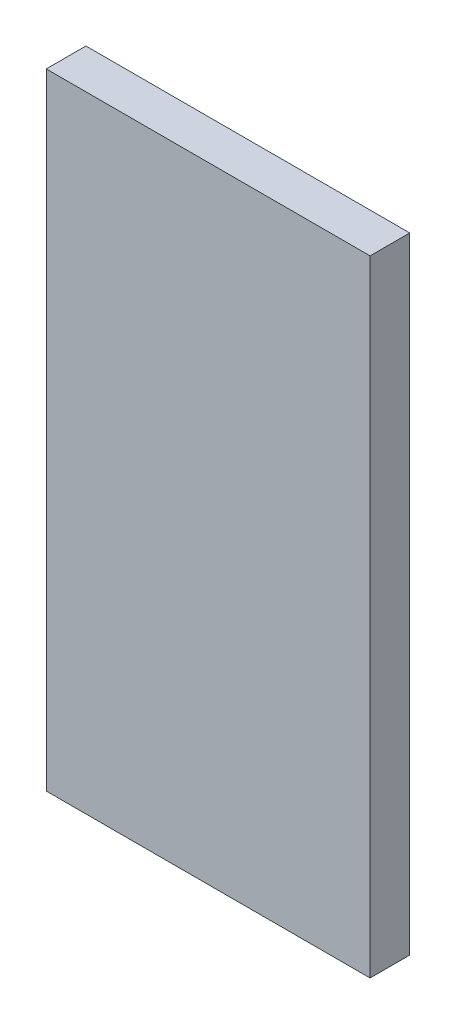
ISO-10303-21;
HEADER;
FILE_DESCRIPTION(('STEP AP214'),'2;1');
FILE_NAME('part.step','',(''),(''),'','','');
FILE_SCHEMA(('AUTOMOTIVE_DESIGN { 1 0 10303 214 1 1 1 1 }'));
ENDSEC;
DATA;
#1=APPLICATION_CONTEXT('core data for automotive mechanical design processes');
#2=APPLICATION_PROTOCOL_DEFINITION('international standard','automotive_design',2000,#1);
#3=PRODUCT_CONTEXT('',#1,'mechanical');
#4=PRODUCT('Part','Part','',(#3));
#5=PRODUCT_RELATED_PRODUCT_CATEGORY('part','',(#4));
#6=PRODUCT_DEFINITION_FORMATION('','',#4);
#7=PRODUCT_DEFINITION_CONTEXT('part definition',#1,'design');
#8=PRODUCT_DEFINITION('design','',#6,#7);
#9=PRODUCT_DEFINITION_SHAPE('','',#8);
#10=(LENGTH_UNIT() NAMED_UNIT(*) SI_UNIT(.MILLI.,.METRE.));
#11=(NAMED_UNIT(*) PLANE_ANGLE_UNIT() SI_UNIT($,.RADIAN.));
#12=(NAMED_UNIT(*) SI_UNIT($,.STERADIAN.) SOLID_ANGLE_UNIT());
#13=UNCERTAINTY_MEASURE_WITH_UNIT(LENGTH_MEASURE(1.E-05),#10,'distance_accuracy_value','');
#14=(GEOMETRIC_REPRESENTATION_CONTEXT(3) GLOBAL_UNCERTAINTY_ASSIGNED_CONTEXT((#13)) GLOBAL_UNIT_ASSIGNED_CONTEXT((#10,
#11,#12)) REPRESENTATION_CONTEXT('',''));
#15=CARTESIAN_POINT('',(0.,0.,0.));
#16=DIRECTION('',(0.,0.,1.));
#17=DIRECTION('',(1.,0.,0.));
#18=AXIS2_PLACEMENT_3D('',#15,#16,#17);
#19=CARTESIAN_POINT('',(-8.028,2.122,0.1));
#20=DIRECTION('',(0.,0.,1.));
#21=DIRECTION('',(1.,0.,0.));
#22=AXIS2_PLACEMENT_3D('',#19,#20,#21);
#23=PLANE('',#22);
#24=DIRECTION('',(0.,1.,0.));
#25=VECTOR('',#24,1.);
#26=CARTESIAN_POINT('',(-7.212,2.122,0.1));
#27=LINE('',#26,#25);
#28=CARTESIAN_POINT('',(-7.212,3.698,0.1));
#29=VERTEX_POINT('',#28);
#30=CARTESIAN_POINT('',(-7.212,2.122,0.1));
#31=VERTEX_POINT('',#30);
#32=EDGE_CURVE('E75',#29,#31,#27,.F.);
#33=ORIENTED_EDGE('',*,*,#32,.F.);
#34=DIRECTION('',(1.,0.,0.));
#35=VECTOR('',#34,1.);
#36=CARTESIAN_POINT('',(-8.028,3.698,0.1));
#37=LINE('',#36,#35);
#38=CARTESIAN_POINT('',(-8.028,3.698,0.1));
#39=VERTEX_POINT('',#38);
#40=EDGE_CURVE('E57',#39,#29,#37,.T.);
#41=ORIENTED_EDGE('',*,*,#40,.F.);
#42=DIRECTION('',(0.,1.,0.));
#43=VECTOR('',#42,1.);
#44=CARTESIAN_POINT('',(-8.028,2.122,0.1));
#45=LINE('',#44,#43);
#46=CARTESIAN_POINT('',(-8.028,2.122,0.1));
#47=VERTEX_POINT('',#46);
#48=EDGE_CURVE('E19',#39,#47,#45,.F.);
#49=ORIENTED_EDGE('',*,*,#48,.T.);
#50=DIRECTION('',(1.,0.,0.));
#51=VECTOR('',#50,1.);
#52=CARTESIAN_POINT('',(-8.028,2.122,0.1));
#53=LINE('',#52,#51);
#54=EDGE_CURVE('E54',#47,#31,#53,.T.);
#55=ORIENTED_EDGE('',*,*,#54,.T.);
#56=EDGE_LOOP('',(#33,#41,#49,#55));
#57=FACE_BOUND('',#56,.T.);
#58=ADVANCED_FACE('F16',(#57),#23,.T.);
#59=CARTESIAN_POINT('',(-8.028,2.122,0.));
#60=DIRECTION('',(1.,0.,0.));
#61=DIRECTION('',(0.,0.,-1.));
#62=AXIS2_PLACEMENT_3D('',#59,#60,#61);
#63=PLANE('',#62);
#64=DIRECTION('',(0.,0.,1.));
#65=VECTOR('',#64,1.);
#66=CARTESIAN_POINT('',(-8.028,3.698,0.));
#67=LINE('',#66,#65);
#68=CARTESIAN_POINT('',(-8.028,3.698,0.));
#69=VERTEX_POINT('',#68);
#70=EDGE_CURVE('E77',#69,#39,#67,.T.);
#71=ORIENTED_EDGE('',*,*,#70,.F.);
#72=DIRECTION('',(0.,1.,0.));
#73=VECTOR('',#72,1.);
#74=CARTESIAN_POINT('',(-8.028,2.122,0.));
#75=LINE('',#74,#73);
#76=CARTESIAN_POINT('',(-8.028,2.122,0.));
#77=VERTEX_POINT('',#76);
#78=EDGE_CURVE('E72',#69,#77,#75,.F.);
#79=ORIENTED_EDGE('',*,*,#78,.T.);
#80=DIRECTION('',(0.,0.,1.));
#81=VECTOR('',#80,1.);
#82=CARTESIAN_POINT('',(-8.028,2.122,0.));
#83=LINE('',#82,#81);
#84=EDGE_CURVE('E62',#77,#47,#83,.T.);
#85=ORIENTED_EDGE('',*,*,#84,.T.);
#86=ORIENTED_EDGE('',*,*,#48,.F.);
#87=EDGE_LOOP('',(#71,#79,#85,#86));
#88=FACE_BOUND('',#87,.T.);
#89=ADVANCED_FACE('F71',(#88),#63,.F.);
#90=CARTESIAN_POINT('',(-8.028,2.122,0.));
#91=DIRECTION('',(0.,1.,0.));
#92=DIRECTION('',(0.,0.,1.));
#93=AXIS2_PLACEMENT_3D('',#90,#91,#92);
#94=PLANE('',#93);
#95=ORIENTED_EDGE('',*,*,#54,.F.);
#96=ORIENTED_EDGE('',*,*,#84,.F.);
#97=DIRECTION('',(1.,0.,0.));
#98=VECTOR('',#97,1.);
#99=CARTESIAN_POINT('',(-8.028,2.122,0.));
#100=LINE('',#99,#98);
#101=CARTESIAN_POINT('',(-7.212,2.122,0.));
#102=VERTEX_POINT('',#101);
#103=EDGE_CURVE('E82',#77,#102,#100,.T.);
#104=ORIENTED_EDGE('',*,*,#103,.T.);
#105=DIRECTION('',(0.,0.,-1.));
#106=VECTOR('',#105,1.);
#107=CARTESIAN_POINT('',(-7.212,2.122,0.));
#108=LINE('',#107,#106);
#109=EDGE_CURVE('E68',#31,#102,#108,.T.);
#110=ORIENTED_EDGE('',*,*,#109,.F.);
#111=EDGE_LOOP('',(#95,#96,#104,#110));
#112=FACE_BOUND('',#111,.T.);
#113=ADVANCED_FACE('F65',(#112),#94,.F.);
#114=CARTESIAN_POINT('',(-7.212,2.122,0.));
#115=DIRECTION('',(1.,0.,0.));
#116=DIRECTION('',(0.,0.,-1.));
#117=AXIS2_PLACEMENT_3D('',#114,#115,#116);
#118=PLANE('',#117);
#119=DIRECTION('',(0.,0.,1.));
#120=VECTOR('',#119,1.);
#121=CARTESIAN_POINT('',(-7.212,3.698,0.));
#122=LINE('',#121,#120);
#123=CARTESIAN_POINT('',(-7.212,3.698,0.));
#124=VERTEX_POINT('',#123);
#125=EDGE_CURVE('E33',#29,#124,#122,.F.);
#126=ORIENTED_EDGE('',*,*,#125,.F.);
#127=ORIENTED_EDGE('',*,*,#32,.T.);
#128=ORIENTED_EDGE('',*,*,#109,.T.);
#129=DIRECTION('',(0.,1.,0.));
#130=VECTOR('',#129,1.);
#131=CARTESIAN_POINT('',(-7.212,2.122,0.));
#132=LINE('',#131,#130);
#133=EDGE_CURVE('E25',#102,#124,#132,.T.);
#134=ORIENTED_EDGE('',*,*,#133,.T.);
#135=EDGE_LOOP('',(#126,#127,#128,#134));
#136=FACE_BOUND('',#135,.T.);
#137=ADVANCED_FACE('F87',(#136),#118,.T.);
#138=CARTESIAN_POINT('',(-8.028,3.698,0.));
#139=DIRECTION('',(0.,1.,0.));
#140=DIRECTION('',(0.,0.,1.));
#141=AXIS2_PLACEMENT_3D('',#138,#139,#140);
#142=PLANE('',#141);
#143=ORIENTED_EDGE('',*,*,#40,.T.);
#144=ORIENTED_EDGE('',*,*,#125,.T.);
#145=DIRECTION('',(1.,0.,0.));
#146=VECTOR('',#145,1.);
#147=CARTESIAN_POINT('',(-8.028,3.698,0.));
#148=LINE('',#147,#146);
#149=EDGE_CURVE('E11',#124,#69,#148,.F.);
#150=ORIENTED_EDGE('',*,*,#149,.T.);
#151=ORIENTED_EDGE('',*,*,#70,.T.);
#152=EDGE_LOOP('',(#143,#144,#150,#151));
#153=FACE_BOUND('',#152,.T.);
#154=ADVANCED_FACE('F90',(#153),#142,.T.);
#155=CARTESIAN_POINT('',(-8.028,2.122,0.));
#156=DIRECTION('',(0.,0.,1.));
#157=DIRECTION('',(1.,0.,0.));
#158=AXIS2_PLACEMENT_3D('',#155,#156,#157);
#159=PLANE('',#158);
#160=ORIENTED_EDGE('',*,*,#133,.F.);
#161=ORIENTED_EDGE('',*,*,#103,.F.);
#162=ORIENTED_EDGE('',*,*,#78,.F.);
#163=ORIENTED_EDGE('',*,*,#149,.F.);
#164=EDGE_LOOP('',(#160,#161,#162,#163));
#165=FACE_BOUND('',#164,.T.);
#166=ADVANCED_FACE('F89',(#165),#159,.F.);
#167=CLOSED_SHELL('',(#58,#89,#113,#137,#154,#166));
#168=MANIFOLD_SOLID_BREP('B1',#167);
#169=ADVANCED_BREP_SHAPE_REPRESENTATION('',(#18,#168),#14);
#170=SHAPE_DEFINITION_REPRESENTATION(#9,#169);
ENDSEC;
END-ISO-10303-21;
